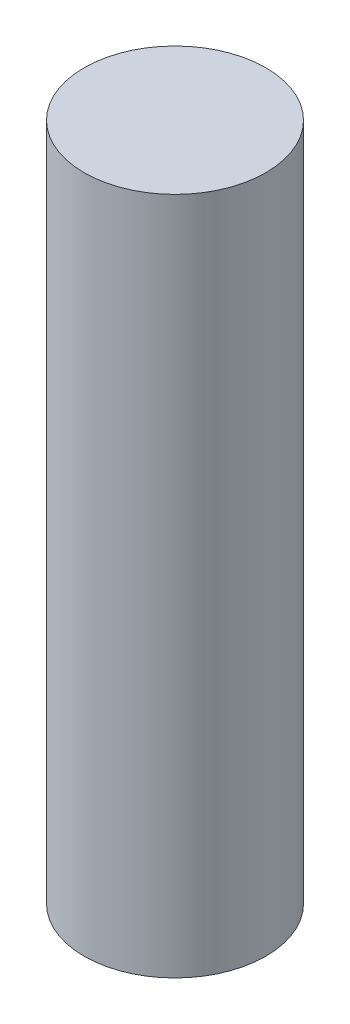
ISO-10303-21;
HEADER;
FILE_DESCRIPTION(('STEP AP214'),'2;1');
FILE_NAME('part.step','',(''),(''),'','','');
FILE_SCHEMA(('AUTOMOTIVE_DESIGN { 1 0 10303 214 1 1 1 1 }'));
ENDSEC;
DATA;
#1=APPLICATION_CONTEXT('core data for automotive mechanical design processes');
#2=APPLICATION_PROTOCOL_DEFINITION('international standard','automotive_design',2000,#1);
#3=PRODUCT_CONTEXT('',#1,'mechanical');
#4=PRODUCT('Part','Part','',(#3));
#5=PRODUCT_RELATED_PRODUCT_CATEGORY('part','',(#4));
#6=PRODUCT_DEFINITION_FORMATION('','',#4);
#7=PRODUCT_DEFINITION_CONTEXT('part definition',#1,'design');
#8=PRODUCT_DEFINITION('design','',#6,#7);
#9=PRODUCT_DEFINITION_SHAPE('','',#8);
#10=(LENGTH_UNIT() NAMED_UNIT(*) SI_UNIT(.MILLI.,.METRE.));
#11=(NAMED_UNIT(*) PLANE_ANGLE_UNIT() SI_UNIT($,.RADIAN.));
#12=(NAMED_UNIT(*) SI_UNIT($,.STERADIAN.) SOLID_ANGLE_UNIT());
#13=UNCERTAINTY_MEASURE_WITH_UNIT(LENGTH_MEASURE(1.E-05),#10,'distance_accuracy_value','');
#14=(GEOMETRIC_REPRESENTATION_CONTEXT(3) GLOBAL_UNCERTAINTY_ASSIGNED_CONTEXT((#13)) GLOBAL_UNIT_ASSIGNED_CONTEXT((#10,
#11,#12)) REPRESENTATION_CONTEXT('',''));
#15=CARTESIAN_POINT('',(0.,0.,0.));
#16=DIRECTION('',(0.,0.,1.));
#17=DIRECTION('',(1.,0.,0.));
#18=AXIS2_PLACEMENT_3D('',#15,#16,#17);
#19=CARTESIAN_POINT('',(0.,28.,0.));
#20=DIRECTION('',(0.,-1.,0.));
#21=DIRECTION('',(0.,0.,-1.));
#22=AXIS2_PLACEMENT_3D('',#19,#20,#21);
#23=CYLINDRICAL_SURFACE('',#22,3.75);
#24=CARTESIAN_POINT('',(0.,28.,0.));
#25=DIRECTION('',(0.,1.,0.));
#26=DIRECTION('',(0.,0.,1.));
#27=AXIS2_PLACEMENT_3D('',#24,#25,#26);
#28=CIRCLE('',#27,3.75);
#29=CARTESIAN_POINT('',(0.,28.,3.75));
#30=VERTEX_POINT('',#29);
#31=EDGE_CURVE('E10',#30,#30,#28,.T.);
#32=ORIENTED_EDGE('',*,*,#31,.F.);
#33=EDGE_LOOP('',(#32));
#34=FACE_BOUND('',#33,.T.);
#35=CARTESIAN_POINT('',(0.,0.,0.));
#36=DIRECTION('',(0.,1.,0.));
#37=DIRECTION('',(0.,0.,1.));
#38=AXIS2_PLACEMENT_3D('',#35,#36,#37);
#39=CIRCLE('',#38,3.75);
#40=CARTESIAN_POINT('',(0.,0.,3.75));
#41=VERTEX_POINT('',#40);
#42=EDGE_CURVE('E36',#41,#41,#39,.T.);
#43=ORIENTED_EDGE('',*,*,#42,.T.);
#44=EDGE_LOOP('',(#43));
#45=FACE_BOUND('',#44,.T.);
#46=ADVANCED_FACE('F33',(#34,#45),#23,.T.);
#47=CARTESIAN_POINT('',(0.,28.,0.));
#48=DIRECTION('',(0.,1.,0.));
#49=DIRECTION('',(0.,0.,1.));
#50=AXIS2_PLACEMENT_3D('',#47,#48,#49);
#51=PLANE('',#50);
#52=ORIENTED_EDGE('',*,*,#31,.T.);
#53=EDGE_LOOP('',(#52));
#54=FACE_BOUND('',#53,.T.);
#55=ADVANCED_FACE('F48',(#54),#51,.T.);
#56=CARTESIAN_POINT('',(0.,0.,0.));
#57=DIRECTION('',(0.,1.,0.));
#58=DIRECTION('',(0.,0.,1.));
#59=AXIS2_PLACEMENT_3D('',#56,#57,#58);
#60=PLANE('',#59);
#61=ORIENTED_EDGE('',*,*,#42,.F.);
#62=EDGE_LOOP('',(#61));
#63=FACE_BOUND('',#62,.T.);
#64=ADVANCED_FACE('F46',(#63),#60,.F.);
#65=CLOSED_SHELL('',(#46,#55,#64));
#66=MANIFOLD_SOLID_BREP('B2',#65);
#67=ADVANCED_BREP_SHAPE_REPRESENTATION('',(#18,#66),#14);
#68=SHAPE_DEFINITION_REPRESENTATION(#9,#67);
ENDSEC;
END-ISO-10303-21;
